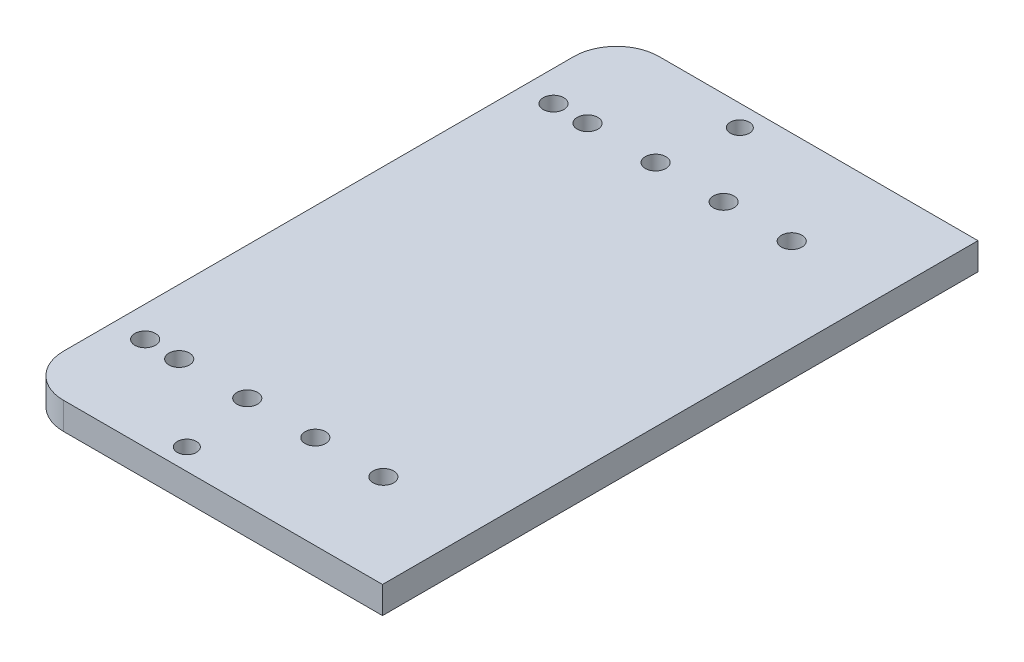
ISO-10303-21;
HEADER;
FILE_DESCRIPTION(('STEP AP214'),'2;1');
FILE_NAME('part.step','',(''),(''),'','','');
FILE_SCHEMA(('AUTOMOTIVE_DESIGN { 1 0 10303 214 1 1 1 1 }'));
ENDSEC;
DATA;
#1=APPLICATION_CONTEXT('core data for automotive mechanical design processes');
#2=APPLICATION_PROTOCOL_DEFINITION('international standard','automotive_design',2000,#1);
#3=PRODUCT_CONTEXT('',#1,'mechanical');
#4=PRODUCT('Part','Part','',(#3));
#5=PRODUCT_RELATED_PRODUCT_CATEGORY('part','',(#4));
#6=PRODUCT_DEFINITION_FORMATION('','',#4);
#7=PRODUCT_DEFINITION_CONTEXT('part definition',#1,'design');
#8=PRODUCT_DEFINITION('design','',#6,#7);
#9=PRODUCT_DEFINITION_SHAPE('','',#8);
#10=(LENGTH_UNIT() NAMED_UNIT(*) SI_UNIT(.MILLI.,.METRE.));
#11=(NAMED_UNIT(*) PLANE_ANGLE_UNIT() SI_UNIT($,.RADIAN.));
#12=(NAMED_UNIT(*) SI_UNIT($,.STERADIAN.) SOLID_ANGLE_UNIT());
#13=UNCERTAINTY_MEASURE_WITH_UNIT(LENGTH_MEASURE(1.E-05),#10,'distance_accuracy_value','');
#14=(GEOMETRIC_REPRESENTATION_CONTEXT(3) GLOBAL_UNCERTAINTY_ASSIGNED_CONTEXT((#13)) GLOBAL_UNIT_ASSIGNED_CONTEXT((#10,
#11,#12)) REPRESENTATION_CONTEXT('',''));
#15=CARTESIAN_POINT('',(0.,0.,0.));
#16=DIRECTION('',(0.,0.,1.));
#17=DIRECTION('',(1.,0.,0.));
#18=AXIS2_PLACEMENT_3D('',#15,#16,#17);
#19=CARTESIAN_POINT('',(-202.606308554324,6.35,35.56948084));
#20=DIRECTION('',(1.,0.,0.));
#21=DIRECTION('',(0.,0.,-1.));
#22=AXIS2_PLACEMENT_3D('',#19,#20,#21);
#23=PLANE('',#22);
#24=DIRECTION('',(0.,0.,1.));
#25=VECTOR('',#24,1.);
#26=CARTESIAN_POINT('',(-202.606308554324,0.,35.56948084));
#27=LINE('',#26,#25);
#28=CARTESIAN_POINT('',(-202.606308554324,0.,45.56948084));
#29=VERTEX_POINT('',#28);
#30=CARTESIAN_POINT('',(-202.606308554323,0.,165.56948084));
#31=VERTEX_POINT('',#30);
#32=EDGE_CURVE('E116',#29,#31,#27,.T.);
#33=ORIENTED_EDGE('',*,*,#32,.T.);
#34=DIRECTION('',(0.,-1.,0.));
#35=VECTOR('',#34,1.);
#36=CARTESIAN_POINT('',(-202.606308554323,6.35,165.56948084));
#37=LINE('',#36,#35);
#38=CARTESIAN_POINT('',(-202.606308554323,6.35,165.56948084));
#39=VERTEX_POINT('',#38);
#40=EDGE_CURVE('E54',#31,#39,#37,.F.);
#41=ORIENTED_EDGE('',*,*,#40,.T.);
#42=DIRECTION('',(0.,0.,1.));
#43=VECTOR('',#42,1.);
#44=CARTESIAN_POINT('',(-202.606308554324,6.35,35.56948084));
#45=LINE('',#44,#43);
#46=CARTESIAN_POINT('',(-202.606308554324,6.35,45.56948084));
#47=VERTEX_POINT('',#46);
#48=EDGE_CURVE('E97',#47,#39,#45,.T.);
#49=ORIENTED_EDGE('',*,*,#48,.F.);
#50=DIRECTION('',(0.,-1.,0.));
#51=VECTOR('',#50,1.);
#52=CARTESIAN_POINT('',(-202.606308554324,6.35,45.56948084));
#53=LINE('',#52,#51);
#54=EDGE_CURVE('E130',#47,#29,#53,.T.);
#55=ORIENTED_EDGE('',*,*,#54,.T.);
#56=EDGE_LOOP('',(#33,#41,#49,#55));
#57=FACE_BOUND('',#56,.T.);
#58=ADVANCED_FACE('F33',(#57),#23,.F.);
#59=CARTESIAN_POINT('',(-202.606308554323,6.35,175.56948084));
#60=DIRECTION('',(0.,0.,-1.));
#61=DIRECTION('',(-1.,0.,0.));
#62=AXIS2_PLACEMENT_3D('',#59,#60,#61);
#63=PLANE('',#62);
#64=DIRECTION('',(1.,0.,0.));
#65=VECTOR('',#64,1.);
#66=CARTESIAN_POINT('',(-202.606308554323,6.35,175.56948084));
#67=LINE('',#66,#65);
#68=CARTESIAN_POINT('',(-192.606308554323,6.35,175.56948084));
#69=VERTEX_POINT('',#68);
#70=CARTESIAN_POINT('',(-117.606308554323,6.35,175.56948084));
#71=VERTEX_POINT('',#70);
#72=EDGE_CURVE('E87',#69,#71,#67,.T.);
#73=ORIENTED_EDGE('',*,*,#72,.F.);
#74=DIRECTION('',(0.,-1.,0.));
#75=VECTOR('',#74,1.);
#76=CARTESIAN_POINT('',(-192.606308554323,6.35,175.56948084));
#77=LINE('',#76,#75);
#78=CARTESIAN_POINT('',(-192.606308554323,0.,175.56948084));
#79=VERTEX_POINT('',#78);
#80=EDGE_CURVE('E106',#69,#79,#77,.T.);
#81=ORIENTED_EDGE('',*,*,#80,.T.);
#82=DIRECTION('',(1.,0.,0.));
#83=VECTOR('',#82,1.);
#84=CARTESIAN_POINT('',(-202.606308554323,0.,175.56948084));
#85=LINE('',#84,#83);
#86=CARTESIAN_POINT('',(-117.606308554323,0.,175.56948084));
#87=VERTEX_POINT('',#86);
#88=EDGE_CURVE('E103',#79,#87,#85,.T.);
#89=ORIENTED_EDGE('',*,*,#88,.T.);
#90=DIRECTION('',(0.,-1.,0.));
#91=VECTOR('',#90,1.);
#92=CARTESIAN_POINT('',(-117.606308554323,6.35,175.56948084));
#93=LINE('',#92,#91);
#94=EDGE_CURVE('E100',#71,#87,#93,.T.);
#95=ORIENTED_EDGE('',*,*,#94,.F.);
#96=EDGE_LOOP('',(#73,#81,#89,#95));
#97=FACE_BOUND('',#96,.T.);
#98=ADVANCED_FACE('F101',(#97),#63,.F.);
#99=CARTESIAN_POINT('',(-117.606308554324,6.35,35.56948084));
#100=DIRECTION('',(-1.,0.,0.));
#101=DIRECTION('',(0.,0.,1.));
#102=AXIS2_PLACEMENT_3D('',#99,#100,#101);
#103=PLANE('',#102);
#104=DIRECTION('',(0.,0.,-1.));
#105=VECTOR('',#104,1.);
#106=CARTESIAN_POINT('',(-117.606308554324,0.,35.56948084));
#107=LINE('',#106,#105);
#108=CARTESIAN_POINT('',(-117.606308554324,0.,35.56948084));
#109=VERTEX_POINT('',#108);
#110=EDGE_CURVE('E120',#87,#109,#107,.T.);
#111=ORIENTED_EDGE('',*,*,#110,.T.);
#112=DIRECTION('',(0.,-1.,0.));
#113=VECTOR('',#112,1.);
#114=CARTESIAN_POINT('',(-117.606308554324,6.35,35.56948084));
#115=LINE('',#114,#113);
#116=CARTESIAN_POINT('',(-117.606308554324,6.35,35.56948084));
#117=VERTEX_POINT('',#116);
#118=EDGE_CURVE('E107',#117,#109,#115,.T.);
#119=ORIENTED_EDGE('',*,*,#118,.F.);
#120=DIRECTION('',(0.,0.,-1.));
#121=VECTOR('',#120,1.);
#122=CARTESIAN_POINT('',(-117.606308554324,6.35,35.56948084));
#123=LINE('',#122,#121);
#124=EDGE_CURVE('E91',#71,#117,#123,.T.);
#125=ORIENTED_EDGE('',*,*,#124,.F.);
#126=ORIENTED_EDGE('',*,*,#94,.T.);
#127=EDGE_LOOP('',(#111,#119,#125,#126));
#128=FACE_BOUND('',#127,.T.);
#129=ADVANCED_FACE('F109',(#128),#103,.F.);
#130=CARTESIAN_POINT('',(-202.606308554324,6.35,35.56948084));
#131=DIRECTION('',(0.,0.,1.));
#132=DIRECTION('',(1.,0.,0.));
#133=AXIS2_PLACEMENT_3D('',#130,#131,#132);
#134=PLANE('',#133);
#135=DIRECTION('',(-1.,0.,0.));
#136=VECTOR('',#135,1.);
#137=CARTESIAN_POINT('',(-202.606308554324,0.,35.56948084));
#138=LINE('',#137,#136);
#139=CARTESIAN_POINT('',(-192.606308554324,0.,35.56948084));
#140=VERTEX_POINT('',#139);
#141=EDGE_CURVE('E122',#109,#140,#138,.T.);
#142=ORIENTED_EDGE('',*,*,#141,.T.);
#143=DIRECTION('',(0.,-1.,0.));
#144=VECTOR('',#143,1.);
#145=CARTESIAN_POINT('',(-192.606308554324,6.35,35.56948084));
#146=LINE('',#145,#144);
#147=CARTESIAN_POINT('',(-192.606308554324,6.35,35.56948084));
#148=VERTEX_POINT('',#147);
#149=EDGE_CURVE('E11',#140,#148,#146,.F.);
#150=ORIENTED_EDGE('',*,*,#149,.T.);
#151=DIRECTION('',(-1.,0.,0.));
#152=VECTOR('',#151,1.);
#153=CARTESIAN_POINT('',(-202.606308554324,6.35,35.56948084));
#154=LINE('',#153,#152);
#155=EDGE_CURVE('E111',#117,#148,#154,.T.);
#156=ORIENTED_EDGE('',*,*,#155,.F.);
#157=ORIENTED_EDGE('',*,*,#118,.T.);
#158=EDGE_LOOP('',(#142,#150,#156,#157));
#159=FACE_BOUND('',#158,.T.);
#160=ADVANCED_FACE('F142',(#159),#134,.F.);
#161=CARTESIAN_POINT('',(0.,6.35,0.));
#162=DIRECTION('',(0.,1.,0.));
#163=DIRECTION('',(0.,0.,1.));
#164=AXIS2_PLACEMENT_3D('',#161,#162,#163);
#165=PLANE('',#164);
#166=CARTESIAN_POINT('',(-168.606308554324,6.35,170.56948084));
#167=DIRECTION('',(0.,1.,0.));
#168=DIRECTION('',(0.,0.,1.));
#169=AXIS2_PLACEMENT_3D('',#166,#167,#168);
#170=CIRCLE('',#169,2.24999999999998);
#171=CARTESIAN_POINT('',(-168.606308554324,6.35,172.81948084));
#172=VERTEX_POINT('',#171);
#173=EDGE_CURVE('E224',#172,#172,#170,.T.);
#174=ORIENTED_EDGE('',*,*,#173,.F.);
#175=EDGE_LOOP('',(#174));
#176=FACE_BOUND('',#175,.T.);
#177=CARTESIAN_POINT('',(-168.606308554324,6.35,40.56948084));
#178=DIRECTION('',(0.,1.,0.));
#179=DIRECTION('',(0.,0.,1.));
#180=AXIS2_PLACEMENT_3D('',#177,#178,#179);
#181=CIRCLE('',#180,2.24999999999998);
#182=CARTESIAN_POINT('',(-168.606308554324,6.35,42.81948084));
#183=VERTEX_POINT('',#182);
#184=EDGE_CURVE('E227',#183,#183,#181,.T.);
#185=ORIENTED_EDGE('',*,*,#184,.F.);
#186=EDGE_LOOP('',(#185));
#187=FACE_BOUND('',#186,.T.);
#188=CARTESIAN_POINT('',(-155.406308554324,6.35,57.56948084));
#189=DIRECTION('',(0.,1.,0.));
#190=DIRECTION('',(0.,0.,1.));
#191=AXIS2_PLACEMENT_3D('',#188,#189,#190);
#192=CIRCLE('',#191,2.42500000000001);
#193=CARTESIAN_POINT('',(-155.406308554324,6.35,59.99448084));
#194=VERTEX_POINT('',#193);
#195=EDGE_CURVE('E246',#194,#194,#192,.F.);
#196=ORIENTED_EDGE('',*,*,#195,.T.);
#197=EDGE_LOOP('',(#196));
#198=FACE_BOUND('',#197,.T.);
#199=CARTESIAN_POINT('',(-171.406308554324,6.35,57.56948084));
#200=DIRECTION('',(0.,1.,0.));
#201=DIRECTION('',(0.,0.,1.));
#202=AXIS2_PLACEMENT_3D('',#199,#200,#201);
#203=CIRCLE('',#202,2.42499999999998);
#204=CARTESIAN_POINT('',(-171.406308554324,6.35,59.99448084));
#205=VERTEX_POINT('',#204);
#206=EDGE_CURVE('E247',#205,#205,#203,.F.);
#207=ORIENTED_EDGE('',*,*,#206,.T.);
#208=EDGE_LOOP('',(#207));
#209=FACE_BOUND('',#208,.T.);
#210=CARTESIAN_POINT('',(-187.406308554324,6.35,57.56948084));
#211=DIRECTION('',(0.,1.,0.));
#212=DIRECTION('',(0.,0.,1.));
#213=AXIS2_PLACEMENT_3D('',#210,#211,#212);
#214=CIRCLE('',#213,2.42500000000001);
#215=CARTESIAN_POINT('',(-187.406308554324,6.35,59.99448084));
#216=VERTEX_POINT('',#215);
#217=EDGE_CURVE('E254',#216,#216,#214,.F.);
#218=ORIENTED_EDGE('',*,*,#217,.T.);
#219=EDGE_LOOP('',(#218));
#220=FACE_BOUND('',#219,.T.);
#221=CARTESIAN_POINT('',(-195.406308554324,6.35,57.56948084));
#222=DIRECTION('',(0.,1.,0.));
#223=DIRECTION('',(0.,0.,1.));
#224=AXIS2_PLACEMENT_3D('',#221,#222,#223);
#225=CIRCLE('',#224,2.42500000000001);
#226=CARTESIAN_POINT('',(-195.406308554324,6.35,59.99448084));
#227=VERTEX_POINT('',#226);
#228=EDGE_CURVE('E260',#227,#227,#225,.F.);
#229=ORIENTED_EDGE('',*,*,#228,.T.);
#230=EDGE_LOOP('',(#229));
#231=FACE_BOUND('',#230,.T.);
#232=CARTESIAN_POINT('',(-139.406308554324,6.35,153.56948084));
#233=DIRECTION('',(0.,1.,0.));
#234=DIRECTION('',(0.,0.,1.));
#235=AXIS2_PLACEMENT_3D('',#232,#233,#234);
#236=CIRCLE('',#235,2.42499999999998);
#237=CARTESIAN_POINT('',(-139.406308554324,6.35,155.99448084));
#238=VERTEX_POINT('',#237);
#239=EDGE_CURVE('E266',#238,#238,#236,.F.);
#240=ORIENTED_EDGE('',*,*,#239,.T.);
#241=EDGE_LOOP('',(#240));
#242=FACE_BOUND('',#241,.T.);
#243=CARTESIAN_POINT('',(-155.406308554323,6.35,153.56948084));
#244=DIRECTION('',(0.,1.,0.));
#245=DIRECTION('',(0.,0.,1.));
#246=AXIS2_PLACEMENT_3D('',#243,#244,#245);
#247=CIRCLE('',#246,2.42500000000001);
#248=CARTESIAN_POINT('',(-155.406308554323,6.35,155.99448084));
#249=VERTEX_POINT('',#248);
#250=EDGE_CURVE('E272',#249,#249,#247,.F.);
#251=ORIENTED_EDGE('',*,*,#250,.T.);
#252=EDGE_LOOP('',(#251));
#253=FACE_BOUND('',#252,.T.);
#254=CARTESIAN_POINT('',(-171.406308554324,6.35,153.56948084));
#255=DIRECTION('',(0.,1.,0.));
#256=DIRECTION('',(0.,0.,1.));
#257=AXIS2_PLACEMENT_3D('',#254,#255,#256);
#258=CIRCLE('',#257,2.42499999999998);
#259=CARTESIAN_POINT('',(-171.406308554324,6.35,155.99448084));
#260=VERTEX_POINT('',#259);
#261=EDGE_CURVE('E278',#260,#260,#258,.F.);
#262=ORIENTED_EDGE('',*,*,#261,.T.);
#263=EDGE_LOOP('',(#262));
#264=FACE_BOUND('',#263,.T.);
#265=CARTESIAN_POINT('',(-187.406308554323,6.35,153.56948084));
#266=DIRECTION('',(0.,1.,0.));
#267=DIRECTION('',(0.,0.,1.));
#268=AXIS2_PLACEMENT_3D('',#265,#266,#267);
#269=CIRCLE('',#268,2.42500000000001);
#270=CARTESIAN_POINT('',(-187.406308554323,6.35,155.99448084));
#271=VERTEX_POINT('',#270);
#272=EDGE_CURVE('E284',#271,#271,#269,.F.);
#273=ORIENTED_EDGE('',*,*,#272,.T.);
#274=EDGE_LOOP('',(#273));
#275=FACE_BOUND('',#274,.T.);
#276=CARTESIAN_POINT('',(-195.406308554324,6.35,153.56948084));
#277=DIRECTION('',(0.,1.,0.));
#278=DIRECTION('',(0.,0.,1.));
#279=AXIS2_PLACEMENT_3D('',#276,#277,#278);
#280=CIRCLE('',#279,2.42500000000001);
#281=CARTESIAN_POINT('',(-195.406308554324,6.35,155.99448084));
#282=VERTEX_POINT('',#281);
#283=EDGE_CURVE('E239',#282,#282,#280,.F.);
#284=ORIENTED_EDGE('',*,*,#283,.T.);
#285=EDGE_LOOP('',(#284));
#286=FACE_BOUND('',#285,.T.);
#287=CARTESIAN_POINT('',(-139.406308554324,6.35,57.56948084));
#288=DIRECTION('',(0.,1.,0.));
#289=DIRECTION('',(0.,0.,1.));
#290=AXIS2_PLACEMENT_3D('',#287,#288,#289);
#291=CIRCLE('',#290,2.42499999999998);
#292=CARTESIAN_POINT('',(-139.406308554324,6.35,59.99448084));
#293=VERTEX_POINT('',#292);
#294=EDGE_CURVE('E118',#293,#293,#291,.F.);
#295=ORIENTED_EDGE('',*,*,#294,.T.);
#296=EDGE_LOOP('',(#295));
#297=FACE_BOUND('',#296,.T.);
#298=ORIENTED_EDGE('',*,*,#48,.T.);
#299=CARTESIAN_POINT('',(-192.606308554323,6.35,165.56948084));
#300=DIRECTION('',(0.,1.,0.));
#301=DIRECTION('',(0.,0.,1.));
#302=AXIS2_PLACEMENT_3D('',#299,#300,#301);
#303=CIRCLE('',#302,10.);
#304=EDGE_CURVE('E41',#39,#69,#303,.T.);
#305=ORIENTED_EDGE('',*,*,#304,.T.);
#306=ORIENTED_EDGE('',*,*,#72,.T.);
#307=ORIENTED_EDGE('',*,*,#124,.T.);
#308=ORIENTED_EDGE('',*,*,#155,.T.);
#309=CARTESIAN_POINT('',(-192.606308554324,6.35,45.56948084));
#310=DIRECTION('',(0.,1.,0.));
#311=DIRECTION('',(0.,0.,1.));
#312=AXIS2_PLACEMENT_3D('',#309,#310,#311);
#313=CIRCLE('',#312,10.);
#314=EDGE_CURVE('E134',#148,#47,#313,.T.);
#315=ORIENTED_EDGE('',*,*,#314,.T.);
#316=EDGE_LOOP('',(#298,#305,#306,#307,#308,#315));
#317=FACE_BOUND('',#316,.T.);
#318=ADVANCED_FACE('F89',(#176,#187,#198,#209,#220,#231,#242,#253,#264,#275,#286,#297,#317),
#165,.T.);
#319=CARTESIAN_POINT('',(0.,0.,0.));
#320=DIRECTION('',(0.,1.,0.));
#321=DIRECTION('',(0.,0.,1.));
#322=AXIS2_PLACEMENT_3D('',#319,#320,#321);
#323=PLANE('',#322);
#324=CARTESIAN_POINT('',(-168.606308554324,0.,170.56948084));
#325=DIRECTION('',(0.,-1.,0.));
#326=DIRECTION('',(0.,0.,-1.));
#327=AXIS2_PLACEMENT_3D('',#324,#325,#326);
#328=CIRCLE('',#327,2.24999999999998);
#329=CARTESIAN_POINT('',(-168.606308554324,0.,168.31948084));
#330=VERTEX_POINT('',#329);
#331=EDGE_CURVE('E226',#330,#330,#328,.T.);
#332=ORIENTED_EDGE('',*,*,#331,.F.);
#333=EDGE_LOOP('',(#332));
#334=FACE_BOUND('',#333,.T.);
#335=CARTESIAN_POINT('',(-168.606308554324,0.,40.56948084));
#336=DIRECTION('',(0.,-1.,0.));
#337=DIRECTION('',(0.,0.,-1.));
#338=AXIS2_PLACEMENT_3D('',#335,#336,#337);
#339=CIRCLE('',#338,2.24999999999998);
#340=CARTESIAN_POINT('',(-168.606308554324,0.,38.31948084));
#341=VERTEX_POINT('',#340);
#342=EDGE_CURVE('E228',#341,#341,#339,.T.);
#343=ORIENTED_EDGE('',*,*,#342,.F.);
#344=EDGE_LOOP('',(#343));
#345=FACE_BOUND('',#344,.T.);
#346=CARTESIAN_POINT('',(-155.406308554324,0.,57.56948084));
#347=DIRECTION('',(0.,-1.,0.));
#348=DIRECTION('',(0.,0.,-1.));
#349=AXIS2_PLACEMENT_3D('',#346,#347,#348);
#350=CIRCLE('',#349,2.42500000000001);
#351=CARTESIAN_POINT('',(-155.406308554324,0.,55.14448084));
#352=VERTEX_POINT('',#351);
#353=EDGE_CURVE('E243',#352,#352,#350,.T.);
#354=ORIENTED_EDGE('',*,*,#353,.F.);
#355=EDGE_LOOP('',(#354));
#356=FACE_BOUND('',#355,.T.);
#357=CARTESIAN_POINT('',(-171.406308554324,0.,57.56948084));
#358=DIRECTION('',(0.,-1.,0.));
#359=DIRECTION('',(0.,0.,-1.));
#360=AXIS2_PLACEMENT_3D('',#357,#358,#359);
#361=CIRCLE('',#360,2.42499999999998);
#362=CARTESIAN_POINT('',(-171.406308554324,0.,55.14448084));
#363=VERTEX_POINT('',#362);
#364=EDGE_CURVE('E251',#363,#363,#361,.T.);
#365=ORIENTED_EDGE('',*,*,#364,.F.);
#366=EDGE_LOOP('',(#365));
#367=FACE_BOUND('',#366,.T.);
#368=CARTESIAN_POINT('',(-187.406308554324,0.,57.56948084));
#369=DIRECTION('',(0.,-1.,0.));
#370=DIRECTION('',(0.,0.,-1.));
#371=AXIS2_PLACEMENT_3D('',#368,#369,#370);
#372=CIRCLE('',#371,2.42500000000001);
#373=CARTESIAN_POINT('',(-187.406308554324,0.,55.14448084));
#374=VERTEX_POINT('',#373);
#375=EDGE_CURVE('E257',#374,#374,#372,.T.);
#376=ORIENTED_EDGE('',*,*,#375,.F.);
#377=EDGE_LOOP('',(#376));
#378=FACE_BOUND('',#377,.T.);
#379=CARTESIAN_POINT('',(-195.406308554324,0.,57.56948084));
#380=DIRECTION('',(0.,-1.,0.));
#381=DIRECTION('',(0.,0.,-1.));
#382=AXIS2_PLACEMENT_3D('',#379,#380,#381);
#383=CIRCLE('',#382,2.42500000000001);
#384=CARTESIAN_POINT('',(-195.406308554324,0.,55.14448084));
#385=VERTEX_POINT('',#384);
#386=EDGE_CURVE('E263',#385,#385,#383,.T.);
#387=ORIENTED_EDGE('',*,*,#386,.F.);
#388=EDGE_LOOP('',(#387));
#389=FACE_BOUND('',#388,.T.);
#390=CARTESIAN_POINT('',(-139.406308554324,0.,153.56948084));
#391=DIRECTION('',(0.,-1.,0.));
#392=DIRECTION('',(0.,0.,-1.));
#393=AXIS2_PLACEMENT_3D('',#390,#391,#392);
#394=CIRCLE('',#393,2.42499999999998);
#395=CARTESIAN_POINT('',(-139.406308554324,0.,151.14448084));
#396=VERTEX_POINT('',#395);
#397=EDGE_CURVE('E269',#396,#396,#394,.T.);
#398=ORIENTED_EDGE('',*,*,#397,.F.);
#399=EDGE_LOOP('',(#398));
#400=FACE_BOUND('',#399,.T.);
#401=CARTESIAN_POINT('',(-155.406308554323,0.,153.56948084));
#402=DIRECTION('',(0.,-1.,0.));
#403=DIRECTION('',(0.,0.,-1.));
#404=AXIS2_PLACEMENT_3D('',#401,#402,#403);
#405=CIRCLE('',#404,2.42500000000001);
#406=CARTESIAN_POINT('',(-155.406308554323,0.,151.14448084));
#407=VERTEX_POINT('',#406);
#408=EDGE_CURVE('E275',#407,#407,#405,.T.);
#409=ORIENTED_EDGE('',*,*,#408,.F.);
#410=EDGE_LOOP('',(#409));
#411=FACE_BOUND('',#410,.T.);
#412=CARTESIAN_POINT('',(-171.406308554324,0.,153.56948084));
#413=DIRECTION('',(0.,-1.,0.));
#414=DIRECTION('',(0.,0.,-1.));
#415=AXIS2_PLACEMENT_3D('',#412,#413,#414);
#416=CIRCLE('',#415,2.42499999999998);
#417=CARTESIAN_POINT('',(-171.406308554324,0.,151.14448084));
#418=VERTEX_POINT('',#417);
#419=EDGE_CURVE('E281',#418,#418,#416,.T.);
#420=ORIENTED_EDGE('',*,*,#419,.F.);
#421=EDGE_LOOP('',(#420));
#422=FACE_BOUND('',#421,.T.);
#423=CARTESIAN_POINT('',(-187.406308554323,0.,153.56948084));
#424=DIRECTION('',(0.,-1.,0.));
#425=DIRECTION('',(0.,0.,-1.));
#426=AXIS2_PLACEMENT_3D('',#423,#424,#425);
#427=CIRCLE('',#426,2.42500000000001);
#428=CARTESIAN_POINT('',(-187.406308554323,0.,151.14448084));
#429=VERTEX_POINT('',#428);
#430=EDGE_CURVE('E242',#429,#429,#427,.T.);
#431=ORIENTED_EDGE('',*,*,#430,.F.);
#432=EDGE_LOOP('',(#431));
#433=FACE_BOUND('',#432,.T.);
#434=CARTESIAN_POINT('',(-195.406308554324,0.,153.56948084));
#435=DIRECTION('',(0.,-1.,0.));
#436=DIRECTION('',(0.,0.,-1.));
#437=AXIS2_PLACEMENT_3D('',#434,#435,#436);
#438=CIRCLE('',#437,2.42500000000001);
#439=CARTESIAN_POINT('',(-195.406308554324,0.,151.14448084));
#440=VERTEX_POINT('',#439);
#441=EDGE_CURVE('E236',#440,#440,#438,.T.);
#442=ORIENTED_EDGE('',*,*,#441,.F.);
#443=EDGE_LOOP('',(#442));
#444=FACE_BOUND('',#443,.T.);
#445=CARTESIAN_POINT('',(-139.406308554324,0.,57.56948084));
#446=DIRECTION('',(0.,-1.,0.));
#447=DIRECTION('',(0.,0.,-1.));
#448=AXIS2_PLACEMENT_3D('',#445,#446,#447);
#449=CIRCLE('',#448,2.42499999999998);
#450=CARTESIAN_POINT('',(-139.406308554324,0.,55.14448084));
#451=VERTEX_POINT('',#450);
#452=EDGE_CURVE('E250',#451,#451,#449,.T.);
#453=ORIENTED_EDGE('',*,*,#452,.F.);
#454=EDGE_LOOP('',(#453));
#455=FACE_BOUND('',#454,.T.);
#456=ORIENTED_EDGE('',*,*,#88,.F.);
#457=CARTESIAN_POINT('',(-192.606308554323,0.,165.56948084));
#458=DIRECTION('',(0.,1.,0.));
#459=DIRECTION('',(0.,0.,1.));
#460=AXIS2_PLACEMENT_3D('',#457,#458,#459);
#461=CIRCLE('',#460,10.);
#462=EDGE_CURVE('E128',#79,#31,#461,.F.);
#463=ORIENTED_EDGE('',*,*,#462,.T.);
#464=ORIENTED_EDGE('',*,*,#32,.F.);
#465=CARTESIAN_POINT('',(-192.606308554324,0.,45.56948084));
#466=DIRECTION('',(0.,1.,0.));
#467=DIRECTION('',(0.,0.,1.));
#468=AXIS2_PLACEMENT_3D('',#465,#466,#467);
#469=CIRCLE('',#468,10.);
#470=EDGE_CURVE('E126',#29,#140,#469,.F.);
#471=ORIENTED_EDGE('',*,*,#470,.T.);
#472=ORIENTED_EDGE('',*,*,#141,.F.);
#473=ORIENTED_EDGE('',*,*,#110,.F.);
#474=EDGE_LOOP('',(#456,#463,#464,#471,#472,#473));
#475=FACE_BOUND('',#474,.T.);
#476=ADVANCED_FACE('F141',(#334,#345,#356,#367,#378,#389,#400,#411,#422,#433,#444,#455,#475),
#323,.F.);
#477=CARTESIAN_POINT('',(-192.606308554323,6.35,165.56948084));
#478=DIRECTION('',(0.,-1.,0.));
#479=DIRECTION('',(0.,0.,-1.));
#480=AXIS2_PLACEMENT_3D('',#477,#478,#479);
#481=CYLINDRICAL_SURFACE('',#480,10.);
#482=ORIENTED_EDGE('',*,*,#304,.F.);
#483=ORIENTED_EDGE('',*,*,#40,.F.);
#484=ORIENTED_EDGE('',*,*,#462,.F.);
#485=ORIENTED_EDGE('',*,*,#80,.F.);
#486=EDGE_LOOP('',(#482,#483,#484,#485));
#487=FACE_BOUND('',#486,.T.);
#488=ADVANCED_FACE('F159',(#487),#481,.T.);
#489=CARTESIAN_POINT('',(-192.606308554324,6.35,45.56948084));
#490=DIRECTION('',(0.,-1.,0.));
#491=DIRECTION('',(0.,0.,-1.));
#492=AXIS2_PLACEMENT_3D('',#489,#490,#491);
#493=CYLINDRICAL_SURFACE('',#492,10.);
#494=ORIENTED_EDGE('',*,*,#314,.F.);
#495=ORIENTED_EDGE('',*,*,#149,.F.);
#496=ORIENTED_EDGE('',*,*,#470,.F.);
#497=ORIENTED_EDGE('',*,*,#54,.F.);
#498=EDGE_LOOP('',(#494,#495,#496,#497));
#499=FACE_BOUND('',#498,.T.);
#500=ADVANCED_FACE('F35',(#499),#493,.T.);
#501=CARTESIAN_POINT('',(-139.406308554324,13.2089357775095,57.56948084));
#502=DIRECTION('',(0.,-1.,0.));
#503=DIRECTION('',(0.,0.,-1.));
#504=AXIS2_PLACEMENT_3D('',#501,#502,#503);
#505=CYLINDRICAL_SURFACE('',#504,2.42499999999998);
#506=ORIENTED_EDGE('',*,*,#452,.T.);
#507=EDGE_LOOP('',(#506));
#508=FACE_BOUND('',#507,.T.);
#509=ORIENTED_EDGE('',*,*,#294,.F.);
#510=EDGE_LOOP('',(#509));
#511=FACE_BOUND('',#510,.T.);
#512=ADVANCED_FACE('F166',(#508,#511),#505,.F.);
#513=CARTESIAN_POINT('',(-195.406308554324,13.2089357775095,153.56948084));
#514=DIRECTION('',(0.,-1.,0.));
#515=DIRECTION('',(0.,0.,-1.));
#516=AXIS2_PLACEMENT_3D('',#513,#514,#515);
#517=CYLINDRICAL_SURFACE('',#516,2.42500000000001);
#518=ORIENTED_EDGE('',*,*,#441,.T.);
#519=EDGE_LOOP('',(#518));
#520=FACE_BOUND('',#519,.T.);
#521=ORIENTED_EDGE('',*,*,#283,.F.);
#522=EDGE_LOOP('',(#521));
#523=FACE_BOUND('',#522,.T.);
#524=ADVANCED_FACE('F175',(#520,#523),#517,.F.);
#525=CARTESIAN_POINT('',(-187.406308554323,13.2089357775095,153.56948084));
#526=DIRECTION('',(0.,-1.,0.));
#527=DIRECTION('',(0.,0.,-1.));
#528=AXIS2_PLACEMENT_3D('',#525,#526,#527);
#529=CYLINDRICAL_SURFACE('',#528,2.42500000000001);
#530=ORIENTED_EDGE('',*,*,#430,.T.);
#531=EDGE_LOOP('',(#530));
#532=FACE_BOUND('',#531,.T.);
#533=ORIENTED_EDGE('',*,*,#272,.F.);
#534=EDGE_LOOP('',(#533));
#535=FACE_BOUND('',#534,.T.);
#536=ADVANCED_FACE('F177',(#532,#535),#529,.F.);
#537=CARTESIAN_POINT('',(-171.406308554324,13.2089357775095,153.56948084));
#538=DIRECTION('',(0.,-1.,0.));
#539=DIRECTION('',(0.,0.,-1.));
#540=AXIS2_PLACEMENT_3D('',#537,#538,#539);
#541=CYLINDRICAL_SURFACE('',#540,2.42499999999998);
#542=ORIENTED_EDGE('',*,*,#419,.T.);
#543=EDGE_LOOP('',(#542));
#544=FACE_BOUND('',#543,.T.);
#545=ORIENTED_EDGE('',*,*,#261,.F.);
#546=EDGE_LOOP('',(#545));
#547=FACE_BOUND('',#546,.T.);
#548=ADVANCED_FACE('F180',(#544,#547),#541,.F.);
#549=CARTESIAN_POINT('',(-155.406308554323,13.2089357775095,153.56948084));
#550=DIRECTION('',(0.,-1.,0.));
#551=DIRECTION('',(0.,0.,-1.));
#552=AXIS2_PLACEMENT_3D('',#549,#550,#551);
#553=CYLINDRICAL_SURFACE('',#552,2.42500000000001);
#554=ORIENTED_EDGE('',*,*,#408,.T.);
#555=EDGE_LOOP('',(#554));
#556=FACE_BOUND('',#555,.T.);
#557=ORIENTED_EDGE('',*,*,#250,.F.);
#558=EDGE_LOOP('',(#557));
#559=FACE_BOUND('',#558,.T.);
#560=ADVANCED_FACE('F184',(#556,#559),#553,.F.);
#561=CARTESIAN_POINT('',(-139.406308554324,13.2089357775095,153.56948084));
#562=DIRECTION('',(0.,-1.,0.));
#563=DIRECTION('',(0.,0.,-1.));
#564=AXIS2_PLACEMENT_3D('',#561,#562,#563);
#565=CYLINDRICAL_SURFACE('',#564,2.42499999999998);
#566=ORIENTED_EDGE('',*,*,#397,.T.);
#567=EDGE_LOOP('',(#566));
#568=FACE_BOUND('',#567,.T.);
#569=ORIENTED_EDGE('',*,*,#239,.F.);
#570=EDGE_LOOP('',(#569));
#571=FACE_BOUND('',#570,.T.);
#572=ADVANCED_FACE('F188',(#568,#571),#565,.F.);
#573=CARTESIAN_POINT('',(-195.406308554324,13.2089357775095,57.56948084));
#574=DIRECTION('',(0.,-1.,0.));
#575=DIRECTION('',(0.,0.,-1.));
#576=AXIS2_PLACEMENT_3D('',#573,#574,#575);
#577=CYLINDRICAL_SURFACE('',#576,2.42500000000001);
#578=ORIENTED_EDGE('',*,*,#386,.T.);
#579=EDGE_LOOP('',(#578));
#580=FACE_BOUND('',#579,.T.);
#581=ORIENTED_EDGE('',*,*,#228,.F.);
#582=EDGE_LOOP('',(#581));
#583=FACE_BOUND('',#582,.T.);
#584=ADVANCED_FACE('F192',(#580,#583),#577,.F.);
#585=CARTESIAN_POINT('',(-187.406308554324,13.2089357775095,57.56948084));
#586=DIRECTION('',(0.,-1.,0.));
#587=DIRECTION('',(0.,0.,-1.));
#588=AXIS2_PLACEMENT_3D('',#585,#586,#587);
#589=CYLINDRICAL_SURFACE('',#588,2.42500000000001);
#590=ORIENTED_EDGE('',*,*,#375,.T.);
#591=EDGE_LOOP('',(#590));
#592=FACE_BOUND('',#591,.T.);
#593=ORIENTED_EDGE('',*,*,#217,.F.);
#594=EDGE_LOOP('',(#593));
#595=FACE_BOUND('',#594,.T.);
#596=ADVANCED_FACE('F196',(#592,#595),#589,.F.);
#597=CARTESIAN_POINT('',(-171.406308554324,13.2089357775095,57.56948084));
#598=DIRECTION('',(0.,-1.,0.));
#599=DIRECTION('',(0.,0.,-1.));
#600=AXIS2_PLACEMENT_3D('',#597,#598,#599);
#601=CYLINDRICAL_SURFACE('',#600,2.42499999999998);
#602=ORIENTED_EDGE('',*,*,#364,.T.);
#603=EDGE_LOOP('',(#602));
#604=FACE_BOUND('',#603,.T.);
#605=ORIENTED_EDGE('',*,*,#206,.F.);
#606=EDGE_LOOP('',(#605));
#607=FACE_BOUND('',#606,.T.);
#608=ADVANCED_FACE('F200',(#604,#607),#601,.F.);
#609=CARTESIAN_POINT('',(-155.406308554324,13.2089357775095,57.56948084));
#610=DIRECTION('',(0.,-1.,0.));
#611=DIRECTION('',(0.,0.,-1.));
#612=AXIS2_PLACEMENT_3D('',#609,#610,#611);
#613=CYLINDRICAL_SURFACE('',#612,2.42500000000001);
#614=ORIENTED_EDGE('',*,*,#353,.T.);
#615=EDGE_LOOP('',(#614));
#616=FACE_BOUND('',#615,.T.);
#617=ORIENTED_EDGE('',*,*,#195,.F.);
#618=EDGE_LOOP('',(#617));
#619=FACE_BOUND('',#618,.T.);
#620=ADVANCED_FACE('F204',(#616,#619),#613,.F.);
#621=CARTESIAN_POINT('',(-168.606308554324,10.,40.56948084));
#622=DIRECTION('',(0.,-1.,0.));
#623=DIRECTION('',(0.,0.,-1.));
#624=AXIS2_PLACEMENT_3D('',#621,#622,#623);
#625=CYLINDRICAL_SURFACE('',#624,2.24999999999998);
#626=ORIENTED_EDGE('',*,*,#184,.T.);
#627=EDGE_LOOP('',(#626));
#628=FACE_BOUND('',#627,.T.);
#629=ORIENTED_EDGE('',*,*,#342,.T.);
#630=EDGE_LOOP('',(#629));
#631=FACE_BOUND('',#630,.T.);
#632=ADVANCED_FACE('F208',(#628,#631),#625,.F.);
#633=CARTESIAN_POINT('',(-168.606308554324,10.,170.56948084));
#634=DIRECTION('',(0.,-1.,0.));
#635=DIRECTION('',(0.,0.,-1.));
#636=AXIS2_PLACEMENT_3D('',#633,#634,#635);
#637=CYLINDRICAL_SURFACE('',#636,2.24999999999998);
#638=ORIENTED_EDGE('',*,*,#173,.T.);
#639=EDGE_LOOP('',(#638));
#640=FACE_BOUND('',#639,.T.);
#641=ORIENTED_EDGE('',*,*,#331,.T.);
#642=EDGE_LOOP('',(#641));
#643=FACE_BOUND('',#642,.T.);
#644=ADVANCED_FACE('F215',(#640,#643),#637,.F.);
#645=CLOSED_SHELL('',(#58,#98,#129,#160,#318,#476,#488,#500,#512,#524,#536,#548,#560,#572,#584,
#596,#608,#620,#632,#644));
#646=MANIFOLD_SOLID_BREP('B2',#645);
#647=ADVANCED_BREP_SHAPE_REPRESENTATION('',(#18,#646),#14);
#648=SHAPE_DEFINITION_REPRESENTATION(#9,#647);
ENDSEC;
END-ISO-10303-21;
